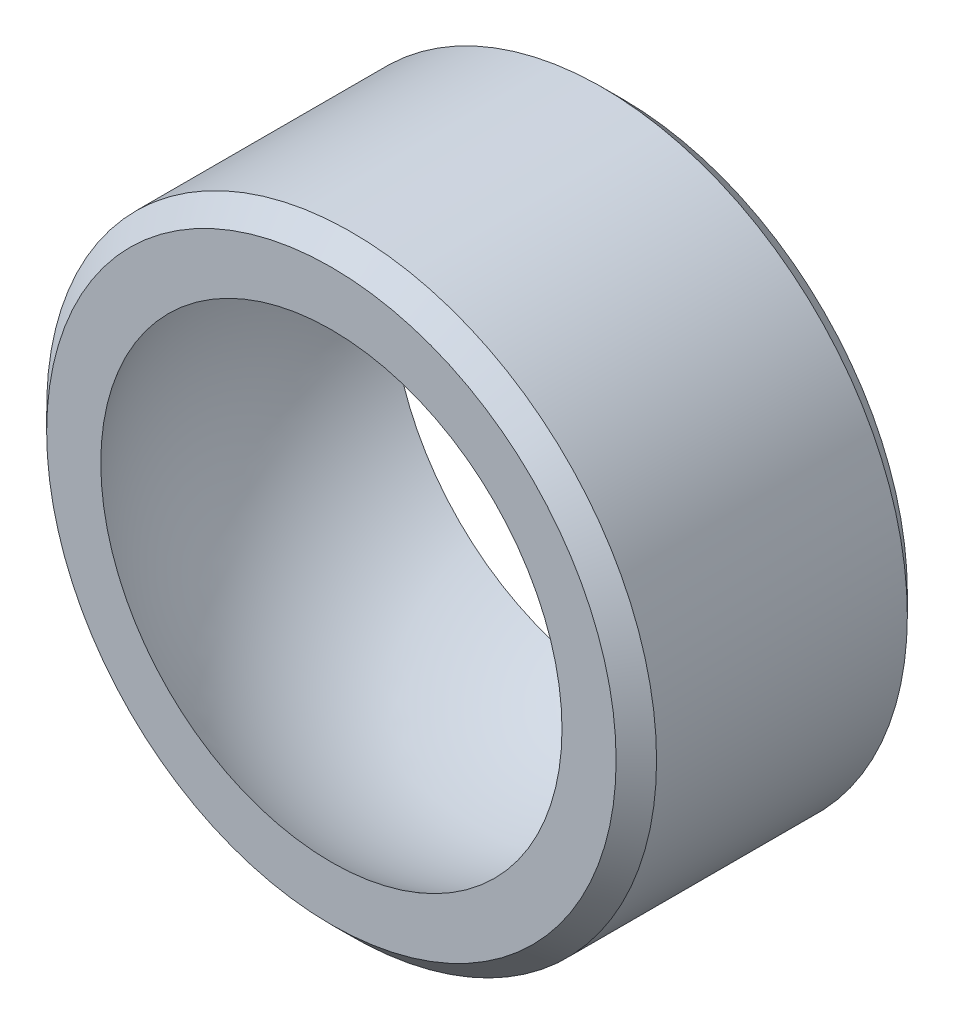
ISO-10303-21;
HEADER;
FILE_DESCRIPTION(('STEP AP214'),'2;1');
FILE_NAME('part.step','',(''),(''),'','','');
FILE_SCHEMA(('AUTOMOTIVE_DESIGN { 1 0 10303 214 1 1 1 1 }'));
ENDSEC;
DATA;
#1=APPLICATION_CONTEXT('core data for automotive mechanical design processes');
#2=APPLICATION_PROTOCOL_DEFINITION('international standard','automotive_design',2000,#1);
#3=PRODUCT_CONTEXT('',#1,'mechanical');
#4=PRODUCT('Part','Part','',(#3));
#5=PRODUCT_RELATED_PRODUCT_CATEGORY('part','',(#4));
#6=PRODUCT_DEFINITION_FORMATION('','',#4);
#7=PRODUCT_DEFINITION_CONTEXT('part definition',#1,'design');
#8=PRODUCT_DEFINITION('design','',#6,#7);
#9=PRODUCT_DEFINITION_SHAPE('','',#8);
#10=(LENGTH_UNIT() NAMED_UNIT(*) SI_UNIT(.MILLI.,.METRE.));
#11=(NAMED_UNIT(*) PLANE_ANGLE_UNIT() SI_UNIT($,.RADIAN.));
#12=(NAMED_UNIT(*) SI_UNIT($,.STERADIAN.) SOLID_ANGLE_UNIT());
#13=UNCERTAINTY_MEASURE_WITH_UNIT(LENGTH_MEASURE(1.E-05),#10,'distance_accuracy_value','');
#14=(GEOMETRIC_REPRESENTATION_CONTEXT(3) GLOBAL_UNCERTAINTY_ASSIGNED_CONTEXT((#13)) GLOBAL_UNIT_ASSIGNED_CONTEXT((#10,
#11,#12)) REPRESENTATION_CONTEXT('',''));
#15=CARTESIAN_POINT('',(0.,0.,0.));
#16=DIRECTION('',(0.,0.,1.));
#17=DIRECTION('',(1.,0.,0.));
#18=AXIS2_PLACEMENT_3D('',#15,#16,#17);
#19=CARTESIAN_POINT('',(0.,0.,-7.2009));
#20=DIRECTION('',(0.,0.,1.));
#21=DIRECTION('',(1.,0.,0.));
#22=AXIS2_PLACEMENT_3D('',#19,#20,#21);
#23=CYLINDRICAL_SURFACE('',#22,15.08125);
#24=CARTESIAN_POINT('',(0.,0.,-6.20089999999998));
#25=DIRECTION('',(0.,0.,1.));
#26=DIRECTION('',(1.,0.,0.));
#27=AXIS2_PLACEMENT_3D('',#24,#25,#26);
#28=CIRCLE('',#27,15.08125);
#29=CARTESIAN_POINT('',(15.08125,0.,-6.20089999999998));
#30=VERTEX_POINT('',#29);
#31=EDGE_CURVE('E49',#30,#30,#28,.T.);
#32=ORIENTED_EDGE('',*,*,#31,.T.);
#33=EDGE_LOOP('',(#32));
#34=FACE_BOUND('',#33,.T.);
#35=CARTESIAN_POINT('',(0.,0.,6.20090000000002));
#36=DIRECTION('',(0.,0.,1.));
#37=DIRECTION('',(1.,0.,0.));
#38=AXIS2_PLACEMENT_3D('',#35,#36,#37);
#39=CIRCLE('',#38,15.08125);
#40=CARTESIAN_POINT('',(15.08125,0.,6.20090000000002));
#41=VERTEX_POINT('',#40);
#42=EDGE_CURVE('E53',#41,#41,#39,.F.);
#43=ORIENTED_EDGE('',*,*,#42,.T.);
#44=EDGE_LOOP('',(#43));
#45=FACE_BOUND('',#44,.T.);
#46=ADVANCED_FACE('F38',(#34,#45),#23,.T.);
#47=CARTESIAN_POINT('',(0.,0.,-7.2009));
#48=DIRECTION('',(0.,0.,1.));
#49=DIRECTION('',(1.,0.,0.));
#50=AXIS2_PLACEMENT_3D('',#47,#48,#49);
#51=PLANE('',#50);
#52=CARTESIAN_POINT('',(0.,0.,-7.2009));
#53=DIRECTION('',(0.,0.,1.));
#54=DIRECTION('',(1.,0.,0.));
#55=AXIS2_PLACEMENT_3D('',#52,#53,#54);
#56=CIRCLE('',#55,11.4042535025314);
#57=CARTESIAN_POINT('',(11.4042535025314,0.,-7.2009));
#58=VERTEX_POINT('',#57);
#59=EDGE_CURVE('E58',#58,#58,#56,.T.);
#60=ORIENTED_EDGE('',*,*,#59,.T.);
#61=EDGE_LOOP('',(#60));
#62=FACE_BOUND('',#61,.T.);
#63=CARTESIAN_POINT('',(0.,0.,-7.2009));
#64=DIRECTION('',(0.,0.,1.));
#65=DIRECTION('',(1.,0.,0.));
#66=AXIS2_PLACEMENT_3D('',#63,#64,#65);
#67=CIRCLE('',#66,14.08125);
#68=CARTESIAN_POINT('',(14.08125,0.,-7.2009));
#69=VERTEX_POINT('',#68);
#70=EDGE_CURVE('E45',#69,#69,#67,.F.);
#71=ORIENTED_EDGE('',*,*,#70,.T.);
#72=EDGE_LOOP('',(#71));
#73=FACE_BOUND('',#72,.T.);
#74=ADVANCED_FACE('F71',(#62,#73),#51,.F.);
#75=CARTESIAN_POINT('',(0.,0.,7.2009));
#76=DIRECTION('',(0.,0.,1.));
#77=DIRECTION('',(1.,0.,0.));
#78=AXIS2_PLACEMENT_3D('',#75,#76,#77);
#79=PLANE('',#78);
#80=CARTESIAN_POINT('',(0.,0.,7.2009));
#81=DIRECTION('',(0.,0.,1.));
#82=DIRECTION('',(1.,0.,0.));
#83=AXIS2_PLACEMENT_3D('',#80,#81,#82);
#84=CIRCLE('',#83,11.4042535025314);
#85=CARTESIAN_POINT('',(11.4042535025314,0.,7.2009));
#86=VERTEX_POINT('',#85);
#87=EDGE_CURVE('E61',#86,#86,#84,.T.);
#88=ORIENTED_EDGE('',*,*,#87,.F.);
#89=EDGE_LOOP('',(#88));
#90=FACE_BOUND('',#89,.T.);
#91=CARTESIAN_POINT('',(0.,0.,7.2009));
#92=DIRECTION('',(0.,0.,1.));
#93=DIRECTION('',(1.,0.,0.));
#94=AXIS2_PLACEMENT_3D('',#91,#92,#93);
#95=CIRCLE('',#94,14.08125);
#96=CARTESIAN_POINT('',(14.08125,0.,7.2009));
#97=VERTEX_POINT('',#96);
#98=EDGE_CURVE('E10',#97,#97,#95,.T.);
#99=ORIENTED_EDGE('',*,*,#98,.T.);
#100=EDGE_LOOP('',(#99));
#101=FACE_BOUND('',#100,.T.);
#102=ADVANCED_FACE('F68',(#90,#101),#79,.T.);
#103=CARTESIAN_POINT('',(0.,0.,-6.20089999999998));
#104=DIRECTION('',(0.,0.,1.));
#105=DIRECTION('',(1.,0.,0.));
#106=AXIS2_PLACEMENT_3D('',#103,#104,#105);
#107=CONICAL_SURFACE('',#106,15.08125,0.78539816339745);
#108=ORIENTED_EDGE('',*,*,#70,.F.);
#109=EDGE_LOOP('',(#108));
#110=FACE_BOUND('',#109,.T.);
#111=ORIENTED_EDGE('',*,*,#31,.F.);
#112=EDGE_LOOP('',(#111));
#113=FACE_BOUND('',#112,.T.);
#114=ADVANCED_FACE('F70',(#110,#113),#107,.T.);
#115=CARTESIAN_POINT('',(0.,0.,7.2009));
#116=DIRECTION('',(0.,0.,-1.));
#117=DIRECTION('',(-1.,0.,0.));
#118=AXIS2_PLACEMENT_3D('',#115,#116,#117);
#119=CONICAL_SURFACE('',#118,14.08125,0.785398163397447);
#120=ORIENTED_EDGE('',*,*,#42,.F.);
#121=EDGE_LOOP('',(#120));
#122=FACE_BOUND('',#121,.T.);
#123=ORIENTED_EDGE('',*,*,#98,.F.);
#124=EDGE_LOOP('',(#123));
#125=FACE_BOUND('',#124,.T.);
#126=ADVANCED_FACE('F40',(#122,#125),#119,.T.);
#127=CARTESIAN_POINT('',(0.,0.,0.));
#128=DIRECTION('',(0.,0.,-1.));
#129=DIRECTION('',(0.,1.,0.));
#130=AXIS2_PLACEMENT_3D('',#127,#128,#129);
#131=SPHERICAL_SURFACE('',#130,13.4874);
#132=ORIENTED_EDGE('',*,*,#87,.T.);
#133=EDGE_LOOP('',(#132));
#134=FACE_BOUND('',#133,.T.);
#135=ORIENTED_EDGE('',*,*,#59,.F.);
#136=EDGE_LOOP('',(#135));
#137=FACE_BOUND('',#136,.T.);
#138=ADVANCED_FACE('F65',(#134,#137),#131,.F.);
#139=CLOSED_SHELL('',(#46,#74,#102,#114,#126,#138));
#140=MANIFOLD_SOLID_BREP('B2',#139);
#141=ADVANCED_BREP_SHAPE_REPRESENTATION('',(#18,#140),#14);
#142=SHAPE_DEFINITION_REPRESENTATION(#9,#141);
ENDSEC;
END-ISO-10303-21;
